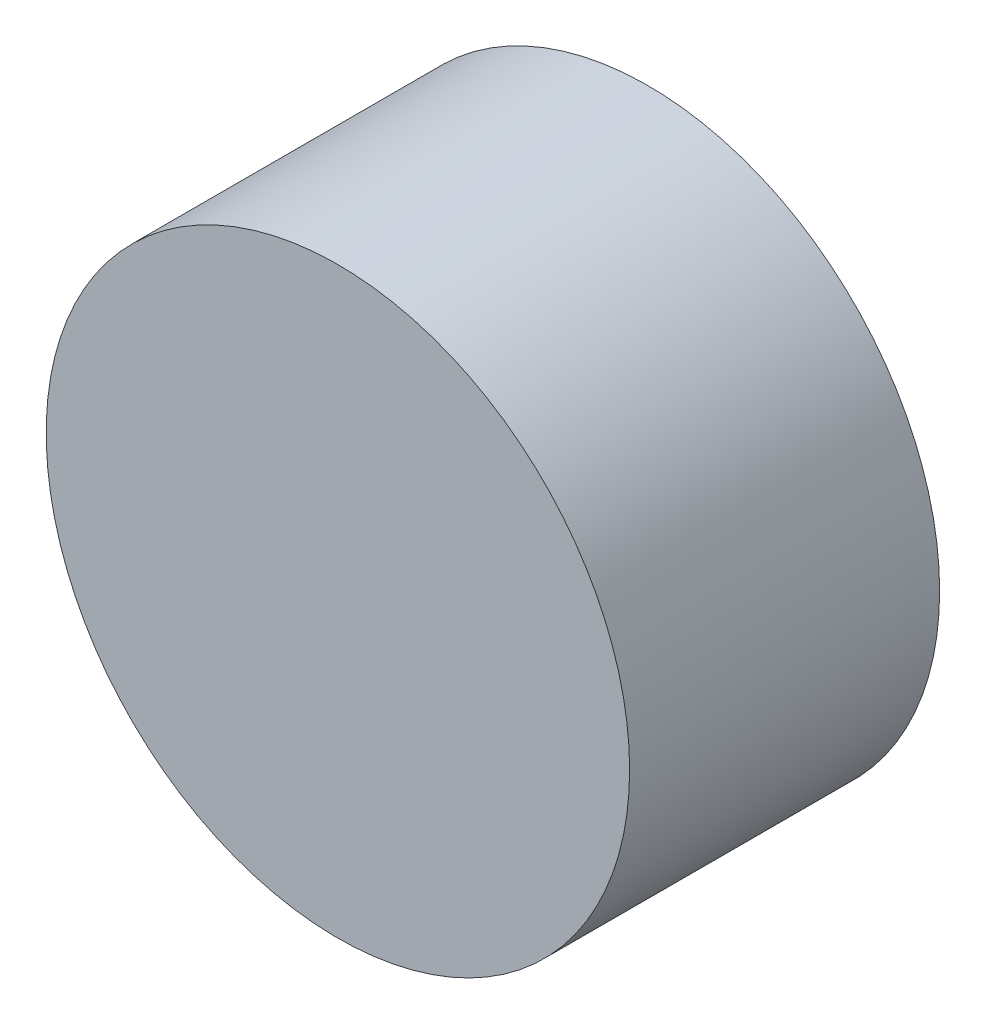
ISO-10303-21;
HEADER;
FILE_DESCRIPTION(('STEP AP214'),'2;1');
FILE_NAME('part.step','',(''),(''),'','','');
FILE_SCHEMA(('AUTOMOTIVE_DESIGN { 1 0 10303 214 1 1 1 1 }'));
ENDSEC;
DATA;
#1=APPLICATION_CONTEXT('core data for automotive mechanical design processes');
#2=APPLICATION_PROTOCOL_DEFINITION('international standard','automotive_design',2000,#1);
#3=PRODUCT_CONTEXT('',#1,'mechanical');
#4=PRODUCT('Part','Part','',(#3));
#5=PRODUCT_RELATED_PRODUCT_CATEGORY('part','',(#4));
#6=PRODUCT_DEFINITION_FORMATION('','',#4);
#7=PRODUCT_DEFINITION_CONTEXT('part definition',#1,'design');
#8=PRODUCT_DEFINITION('design','',#6,#7);
#9=PRODUCT_DEFINITION_SHAPE('','',#8);
#10=(LENGTH_UNIT() NAMED_UNIT(*) SI_UNIT(.MILLI.,.METRE.));
#11=(NAMED_UNIT(*) PLANE_ANGLE_UNIT() SI_UNIT($,.RADIAN.));
#12=(NAMED_UNIT(*) SI_UNIT($,.STERADIAN.) SOLID_ANGLE_UNIT());
#13=UNCERTAINTY_MEASURE_WITH_UNIT(LENGTH_MEASURE(1.E-05),#10,'distance_accuracy_value','');
#14=(GEOMETRIC_REPRESENTATION_CONTEXT(3) GLOBAL_UNCERTAINTY_ASSIGNED_CONTEXT((#13)) GLOBAL_UNIT_ASSIGNED_CONTEXT((#10,
#11,#12)) REPRESENTATION_CONTEXT('',''));
#15=CARTESIAN_POINT('',(0.,0.,0.));
#16=DIRECTION('',(0.,0.,1.));
#17=DIRECTION('',(1.,0.,0.));
#18=AXIS2_PLACEMENT_3D('',#15,#16,#17);
#19=CARTESIAN_POINT('',(0.,0.,10.));
#20=DIRECTION('',(0.,0.,-1.));
#21=DIRECTION('',(-1.,0.,0.));
#22=AXIS2_PLACEMENT_3D('',#19,#20,#21);
#23=CYLINDRICAL_SURFACE('',#22,9.41);
#24=CARTESIAN_POINT('',(0.,0.,10.));
#25=DIRECTION('',(0.,0.,1.));
#26=DIRECTION('',(1.,0.,0.));
#27=AXIS2_PLACEMENT_3D('',#24,#25,#26);
#28=CIRCLE('',#27,9.41);
#29=CARTESIAN_POINT('',(9.41,0.,10.));
#30=VERTEX_POINT('',#29);
#31=EDGE_CURVE('E12',#30,#30,#28,.T.);
#32=ORIENTED_EDGE('',*,*,#31,.F.);
#33=EDGE_LOOP('',(#32));
#34=FACE_BOUND('',#33,.T.);
#35=CARTESIAN_POINT('',(0.,0.,0.));
#36=DIRECTION('',(0.,0.,1.));
#37=DIRECTION('',(1.,0.,0.));
#38=AXIS2_PLACEMENT_3D('',#35,#36,#37);
#39=CIRCLE('',#38,9.41);
#40=CARTESIAN_POINT('',(9.41,0.,0.));
#41=VERTEX_POINT('',#40);
#42=EDGE_CURVE('E44',#41,#41,#39,.T.);
#43=ORIENTED_EDGE('',*,*,#42,.T.);
#44=EDGE_LOOP('',(#43));
#45=FACE_BOUND('',#44,.T.);
#46=ADVANCED_FACE('F41',(#34,#45),#23,.T.);
#47=CARTESIAN_POINT('',(0.,0.,10.));
#48=DIRECTION('',(0.,0.,1.));
#49=DIRECTION('',(1.,0.,0.));
#50=AXIS2_PLACEMENT_3D('',#47,#48,#49);
#51=PLANE('',#50);
#52=ORIENTED_EDGE('',*,*,#31,.T.);
#53=EDGE_LOOP('',(#52));
#54=FACE_BOUND('',#53,.T.);
#55=ADVANCED_FACE('F56',(#54),#51,.T.);
#56=CARTESIAN_POINT('',(0.,0.,0.));
#57=DIRECTION('',(0.,0.,1.));
#58=DIRECTION('',(1.,0.,0.));
#59=AXIS2_PLACEMENT_3D('',#56,#57,#58);
#60=PLANE('',#59);
#61=ORIENTED_EDGE('',*,*,#42,.F.);
#62=EDGE_LOOP('',(#61));
#63=FACE_BOUND('',#62,.T.);
#64=ADVANCED_FACE('F54',(#63),#60,.F.);
#65=CLOSED_SHELL('',(#46,#55,#64));
#66=MANIFOLD_SOLID_BREP('B2',#65);
#67=ADVANCED_BREP_SHAPE_REPRESENTATION('',(#18,#66),#14);
#68=SHAPE_DEFINITION_REPRESENTATION(#9,#67);
ENDSEC;
END-ISO-10303-21;
